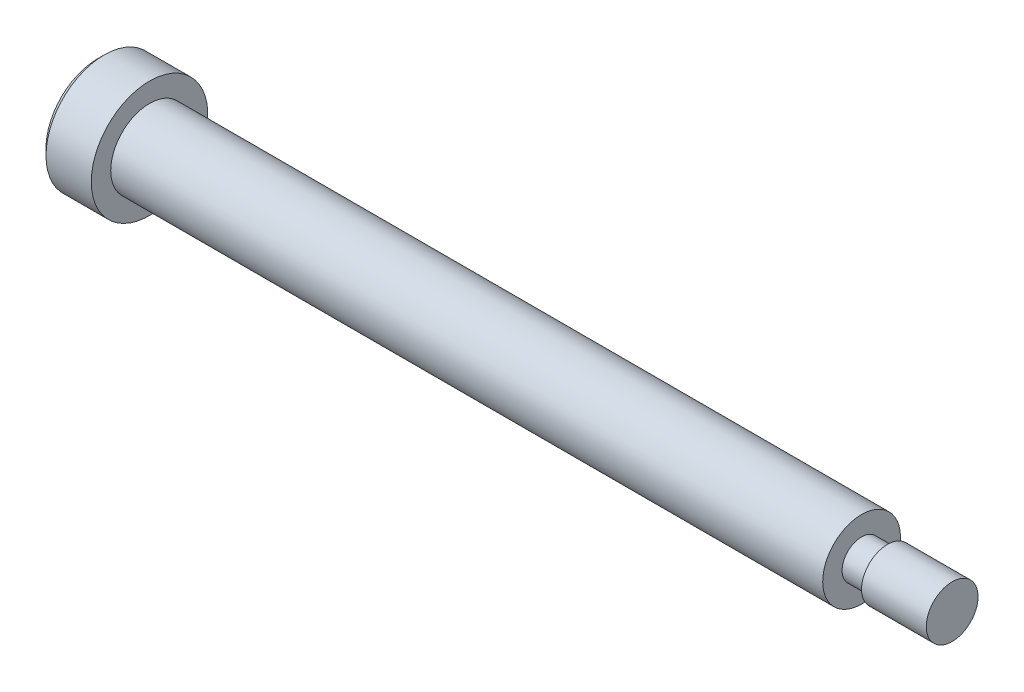
ISO-10303-21;
HEADER;
FILE_DESCRIPTION(('STEP AP214'),'2;1');
FILE_NAME('part.step','',(''),(''),'','','');
FILE_SCHEMA(('AUTOMOTIVE_DESIGN { 1 0 10303 214 1 1 1 1 }'));
ENDSEC;
DATA;
#1=APPLICATION_CONTEXT('core data for automotive mechanical design processes');
#2=APPLICATION_PROTOCOL_DEFINITION('international standard','automotive_design',2000,#1);
#3=PRODUCT_CONTEXT('',#1,'mechanical');
#4=PRODUCT('Part','Part','',(#3));
#5=PRODUCT_RELATED_PRODUCT_CATEGORY('part','',(#4));
#6=PRODUCT_DEFINITION_FORMATION('','',#4);
#7=PRODUCT_DEFINITION_CONTEXT('part definition',#1,'design');
#8=PRODUCT_DEFINITION('design','',#6,#7);
#9=PRODUCT_DEFINITION_SHAPE('','',#8);
#10=(LENGTH_UNIT() NAMED_UNIT(*) SI_UNIT(.MILLI.,.METRE.));
#11=(NAMED_UNIT(*) PLANE_ANGLE_UNIT() SI_UNIT($,.RADIAN.));
#12=(NAMED_UNIT(*) SI_UNIT($,.STERADIAN.) SOLID_ANGLE_UNIT());
#13=UNCERTAINTY_MEASURE_WITH_UNIT(LENGTH_MEASURE(1.E-05),#10,'distance_accuracy_value','');
#14=(GEOMETRIC_REPRESENTATION_CONTEXT(3) GLOBAL_UNCERTAINTY_ASSIGNED_CONTEXT((#13)) GLOBAL_UNIT_ASSIGNED_CONTEXT((#10,
#11,#12)) REPRESENTATION_CONTEXT('',''));
#15=CARTESIAN_POINT('',(0.,0.,0.));
#16=DIRECTION('',(0.,0.,1.));
#17=DIRECTION('',(1.,0.,0.));
#18=AXIS2_PLACEMENT_3D('',#15,#16,#17);
#19=CARTESIAN_POINT('',(0.,4.5,0.));
#20=DIRECTION('',(-1.,0.,0.));
#21=DIRECTION('',(0.,0.,1.));
#22=AXIS2_PLACEMENT_3D('',#19,#20,#21);
#23=PLANE('',#22);
#24=CARTESIAN_POINT('',(0.,0.,0.));
#25=DIRECTION('',(-1.,0.,0.));
#26=DIRECTION('',(0.,0.,1.));
#27=AXIS2_PLACEMENT_3D('',#24,#25,#26);
#28=CIRCLE('',#27,4.5);
#29=CARTESIAN_POINT('',(0.,0.,4.5));
#30=VERTEX_POINT('',#29);
#31=EDGE_CURVE('E156',#30,#30,#28,.T.);
#32=ORIENTED_EDGE('',*,*,#31,.F.);
#33=EDGE_LOOP('',(#32));
#34=FACE_BOUND('',#33,.T.);
#35=CARTESIAN_POINT('',(0.,0.,0.));
#36=DIRECTION('',(-1.,0.,0.));
#37=DIRECTION('',(0.,0.,1.));
#38=AXIS2_PLACEMENT_3D('',#35,#36,#37);
#39=CIRCLE('',#38,3.);
#40=CARTESIAN_POINT('',(0.,0.,3.));
#41=VERTEX_POINT('',#40);
#42=EDGE_CURVE('E133',#41,#41,#39,.T.);
#43=ORIENTED_EDGE('',*,*,#42,.T.);
#44=EDGE_LOOP('',(#43));
#45=FACE_BOUND('',#44,.T.);
#46=ADVANCED_FACE('F31',(#34,#45),#23,.F.);
#47=CARTESIAN_POINT('',(-15.4482466475727,0.,0.));
#48=DIRECTION('',(-1.,0.,0.));
#49=DIRECTION('',(0.,0.,1.));
#50=AXIS2_PLACEMENT_3D('',#47,#48,#49);
#51=CYLINDRICAL_SURFACE('',#50,4.5);
#52=CARTESIAN_POINT('',(-3.50000000000001,0.,0.));
#53=DIRECTION('',(1.,0.,0.));
#54=DIRECTION('',(0.,0.,-1.));
#55=AXIS2_PLACEMENT_3D('',#52,#53,#54);
#56=CIRCLE('',#55,4.5);
#57=CARTESIAN_POINT('',(-3.50000000000001,0.,-4.5));
#58=VERTEX_POINT('',#57);
#59=EDGE_CURVE('E11',#58,#58,#56,.T.);
#60=ORIENTED_EDGE('',*,*,#59,.T.);
#61=EDGE_LOOP('',(#60));
#62=FACE_BOUND('',#61,.T.);
#63=ORIENTED_EDGE('',*,*,#31,.T.);
#64=EDGE_LOOP('',(#63));
#65=FACE_BOUND('',#64,.T.);
#66=ADVANCED_FACE('F178',(#62,#65),#51,.T.);
#67=CARTESIAN_POINT('',(-4.,0.,0.));
#68=DIRECTION('',(1.,0.,0.));
#69=DIRECTION('',(0.,0.,-1.));
#70=AXIS2_PLACEMENT_3D('',#67,#68,#69);
#71=PLANE('',#70);
#72=DIRECTION('',(0.,-0.5,-0.866025403784439));
#73=VECTOR('',#72,1.);
#74=CARTESIAN_POINT('',(-4.,1.73205080756888,0.));
#75=LINE('',#74,#73);
#76=CARTESIAN_POINT('',(-4.,1.73205080756888,0.));
#77=VERTEX_POINT('',#76);
#78=CARTESIAN_POINT('',(-4.,0.866025403784438,-1.5));
#79=VERTEX_POINT('',#78);
#80=EDGE_CURVE('E120',#77,#79,#75,.T.);
#81=ORIENTED_EDGE('',*,*,#80,.F.);
#82=DIRECTION('',(0.,0.5,-0.866025403784439));
#83=VECTOR('',#82,1.);
#84=CARTESIAN_POINT('',(-4.,0.86602540378444,1.5));
#85=LINE('',#84,#83);
#86=CARTESIAN_POINT('',(-4.,0.86602540378444,1.5));
#87=VERTEX_POINT('',#86);
#88=EDGE_CURVE('E46',#87,#77,#85,.T.);
#89=ORIENTED_EDGE('',*,*,#88,.F.);
#90=DIRECTION('',(0.,1.,0.));
#91=VECTOR('',#90,1.);
#92=CARTESIAN_POINT('',(-4.,-0.866025403784439,1.5));
#93=LINE('',#92,#91);
#94=CARTESIAN_POINT('',(-4.,-0.866025403784439,1.5));
#95=VERTEX_POINT('',#94);
#96=EDGE_CURVE('E129',#95,#87,#93,.T.);
#97=ORIENTED_EDGE('',*,*,#96,.F.);
#98=DIRECTION('',(0.,0.5,0.866025403784438));
#99=VECTOR('',#98,1.);
#100=CARTESIAN_POINT('',(-4.,-1.73205080756888,0.));
#101=LINE('',#100,#99);
#102=CARTESIAN_POINT('',(-4.,-1.73205080756888,0.));
#103=VERTEX_POINT('',#102);
#104=EDGE_CURVE('E127',#103,#95,#101,.T.);
#105=ORIENTED_EDGE('',*,*,#104,.F.);
#106=DIRECTION('',(0.,-0.5,0.866025403784439));
#107=VECTOR('',#106,1.);
#108=CARTESIAN_POINT('',(-4.,-0.866025403784439,-1.5));
#109=LINE('',#108,#107);
#110=CARTESIAN_POINT('',(-4.,-0.866025403784439,-1.5));
#111=VERTEX_POINT('',#110);
#112=EDGE_CURVE('E94',#111,#103,#109,.T.);
#113=ORIENTED_EDGE('',*,*,#112,.F.);
#114=DIRECTION('',(0.,-1.,0.));
#115=VECTOR('',#114,1.);
#116=CARTESIAN_POINT('',(-4.,0.866025403784438,-1.5));
#117=LINE('',#116,#115);
#118=EDGE_CURVE('E123',#79,#111,#117,.T.);
#119=ORIENTED_EDGE('',*,*,#118,.F.);
#120=EDGE_LOOP('',(#81,#89,#97,#105,#113,#119));
#121=FACE_BOUND('',#120,.T.);
#122=CARTESIAN_POINT('',(-4.,0.,0.));
#123=DIRECTION('',(1.,0.,0.));
#124=DIRECTION('',(0.,0.,-1.));
#125=AXIS2_PLACEMENT_3D('',#122,#123,#124);
#126=CIRCLE('',#125,4.00000000000001);
#127=CARTESIAN_POINT('',(-4.,0.,-4.00000000000001));
#128=VERTEX_POINT('',#127);
#129=EDGE_CURVE('E39',#128,#128,#126,.F.);
#130=ORIENTED_EDGE('',*,*,#129,.T.);
#131=EDGE_LOOP('',(#130));
#132=FACE_BOUND('',#131,.T.);
#133=ADVANCED_FACE('F161',(#121,#132),#71,.F.);
#134=CARTESIAN_POINT('',(62.,2.,0.));
#135=DIRECTION('',(-1.,0.,0.));
#136=DIRECTION('',(0.,0.,1.));
#137=AXIS2_PLACEMENT_3D('',#134,#135,#136);
#138=PLANE('',#137);
#139=CARTESIAN_POINT('',(62.,0.,0.));
#140=DIRECTION('',(-1.,0.,0.));
#141=DIRECTION('',(0.,0.,1.));
#142=AXIS2_PLACEMENT_3D('',#139,#140,#141);
#143=CIRCLE('',#142,2.);
#144=CARTESIAN_POINT('',(62.,0.,2.));
#145=VERTEX_POINT('',#144);
#146=EDGE_CURVE('E153',#145,#145,#143,.T.);
#147=ORIENTED_EDGE('',*,*,#146,.F.);
#148=EDGE_LOOP('',(#147));
#149=FACE_BOUND('',#148,.T.);
#150=ADVANCED_FACE('F190',(#149),#138,.F.);
#151=CARTESIAN_POINT('',(-15.4482466475727,0.,0.));
#152=DIRECTION('',(-1.,0.,0.));
#153=DIRECTION('',(0.,0.,1.));
#154=AXIS2_PLACEMENT_3D('',#151,#152,#153);
#155=CYLINDRICAL_SURFACE('',#154,2.);
#156=CARTESIAN_POINT('',(57.,0.,0.));
#157=DIRECTION('',(-1.,0.,0.));
#158=DIRECTION('',(0.,0.,1.));
#159=AXIS2_PLACEMENT_3D('',#156,#157,#158);
#160=CIRCLE('',#159,2.);
#161=CARTESIAN_POINT('',(57.,0.,2.));
#162=VERTEX_POINT('',#161);
#163=EDGE_CURVE('E150',#162,#162,#160,.T.);
#164=ORIENTED_EDGE('',*,*,#163,.F.);
#165=EDGE_LOOP('',(#164));
#166=FACE_BOUND('',#165,.T.);
#167=ORIENTED_EDGE('',*,*,#146,.T.);
#168=EDGE_LOOP('',(#167));
#169=FACE_BOUND('',#168,.T.);
#170=ADVANCED_FACE('F194',(#166,#169),#155,.T.);
#171=CARTESIAN_POINT('',(57.,1.5,0.));
#172=DIRECTION('',(1.,0.,0.));
#173=DIRECTION('',(0.,0.,-1.));
#174=AXIS2_PLACEMENT_3D('',#171,#172,#173);
#175=PLANE('',#174);
#176=CARTESIAN_POINT('',(57.,0.,0.));
#177=DIRECTION('',(-1.,0.,0.));
#178=DIRECTION('',(0.,0.,1.));
#179=AXIS2_PLACEMENT_3D('',#176,#177,#178);
#180=CIRCLE('',#179,1.5);
#181=CARTESIAN_POINT('',(57.,0.,1.5));
#182=VERTEX_POINT('',#181);
#183=EDGE_CURVE('E147',#182,#182,#180,.T.);
#184=ORIENTED_EDGE('',*,*,#183,.F.);
#185=EDGE_LOOP('',(#184));
#186=FACE_BOUND('',#185,.T.);
#187=ORIENTED_EDGE('',*,*,#163,.T.);
#188=EDGE_LOOP('',(#187));
#189=FACE_BOUND('',#188,.T.);
#190=ADVANCED_FACE('F198',(#186,#189),#175,.F.);
#191=CARTESIAN_POINT('',(-15.4482466475727,0.,0.));
#192=DIRECTION('',(-1.,0.,0.));
#193=DIRECTION('',(0.,0.,1.));
#194=AXIS2_PLACEMENT_3D('',#191,#192,#193);
#195=CYLINDRICAL_SURFACE('',#194,1.5);
#196=CARTESIAN_POINT('',(55.,0.,0.));
#197=DIRECTION('',(-1.,0.,0.));
#198=DIRECTION('',(0.,0.,1.));
#199=AXIS2_PLACEMENT_3D('',#196,#197,#198);
#200=CIRCLE('',#199,1.5);
#201=CARTESIAN_POINT('',(55.,0.,1.5));
#202=VERTEX_POINT('',#201);
#203=EDGE_CURVE('E144',#202,#202,#200,.T.);
#204=ORIENTED_EDGE('',*,*,#203,.F.);
#205=EDGE_LOOP('',(#204));
#206=FACE_BOUND('',#205,.T.);
#207=ORIENTED_EDGE('',*,*,#183,.T.);
#208=EDGE_LOOP('',(#207));
#209=FACE_BOUND('',#208,.T.);
#210=ADVANCED_FACE('F202',(#206,#209),#195,.T.);
#211=CARTESIAN_POINT('',(55.,3.,0.));
#212=DIRECTION('',(-1.,0.,0.));
#213=DIRECTION('',(0.,0.,1.));
#214=AXIS2_PLACEMENT_3D('',#211,#212,#213);
#215=PLANE('',#214);
#216=CARTESIAN_POINT('',(55.,0.,0.));
#217=DIRECTION('',(-1.,0.,0.));
#218=DIRECTION('',(0.,0.,1.));
#219=AXIS2_PLACEMENT_3D('',#216,#217,#218);
#220=CIRCLE('',#219,3.);
#221=CARTESIAN_POINT('',(55.,0.,3.));
#222=VERTEX_POINT('',#221);
#223=EDGE_CURVE('E141',#222,#222,#220,.T.);
#224=ORIENTED_EDGE('',*,*,#223,.F.);
#225=EDGE_LOOP('',(#224));
#226=FACE_BOUND('',#225,.T.);
#227=ORIENTED_EDGE('',*,*,#203,.T.);
#228=EDGE_LOOP('',(#227));
#229=FACE_BOUND('',#228,.T.);
#230=ADVANCED_FACE('F173',(#226,#229),#215,.F.);
#231=CARTESIAN_POINT('',(-15.4482466475727,0.,0.));
#232=DIRECTION('',(-1.,0.,0.));
#233=DIRECTION('',(0.,0.,1.));
#234=AXIS2_PLACEMENT_3D('',#231,#232,#233);
#235=CYLINDRICAL_SURFACE('',#234,3.);
#236=ORIENTED_EDGE('',*,*,#42,.F.);
#237=EDGE_LOOP('',(#236));
#238=FACE_BOUND('',#237,.T.);
#239=ORIENTED_EDGE('',*,*,#223,.T.);
#240=EDGE_LOOP('',(#239));
#241=FACE_BOUND('',#240,.T.);
#242=ADVANCED_FACE('F165',(#238,#241),#235,.T.);
#243=CARTESIAN_POINT('',(-4.,0.,0.));
#244=DIRECTION('',(1.,0.,0.));
#245=DIRECTION('',(0.,0.,-1.));
#246=AXIS2_PLACEMENT_3D('',#243,#244,#245);
#247=CONICAL_SURFACE('',#246,4.00000000000001,0.785398163397447);
#248=ORIENTED_EDGE('',*,*,#59,.F.);
#249=EDGE_LOOP('',(#248));
#250=FACE_BOUND('',#249,.T.);
#251=ORIENTED_EDGE('',*,*,#129,.F.);
#252=EDGE_LOOP('',(#251));
#253=FACE_BOUND('',#252,.T.);
#254=ADVANCED_FACE('F33',(#250,#253),#247,.T.);
#255=CARTESIAN_POINT('',(-2.,0.86602540378444,1.5));
#256=DIRECTION('',(0.,0.866025403784439,0.5));
#257=DIRECTION('',(0.,-0.5,0.866025403784439));
#258=AXIS2_PLACEMENT_3D('',#255,#256,#257);
#259=PLANE('',#258);
#260=ORIENTED_EDGE('',*,*,#88,.T.);
#261=DIRECTION('',(-1.,0.,0.));
#262=VECTOR('',#261,1.);
#263=CARTESIAN_POINT('',(-2.,1.73205080756888,0.));
#264=LINE('',#263,#262);
#265=CARTESIAN_POINT('',(-2.,1.73205080756888,0.));
#266=VERTEX_POINT('',#265);
#267=EDGE_CURVE('E76',#266,#77,#264,.T.);
#268=ORIENTED_EDGE('',*,*,#267,.F.);
#269=DIRECTION('',(0.,0.5,-0.866025403784439));
#270=VECTOR('',#269,1.);
#271=CARTESIAN_POINT('',(-2.,0.86602540378444,1.5));
#272=LINE('',#271,#270);
#273=CARTESIAN_POINT('',(-2.,0.86602540378444,1.5));
#274=VERTEX_POINT('',#273);
#275=EDGE_CURVE('E131',#274,#266,#272,.T.);
#276=ORIENTED_EDGE('',*,*,#275,.F.);
#277=DIRECTION('',(-1.,0.,0.));
#278=VECTOR('',#277,1.);
#279=CARTESIAN_POINT('',(-2.,0.86602540378444,1.5));
#280=LINE('',#279,#278);
#281=EDGE_CURVE('E54',#274,#87,#280,.T.);
#282=ORIENTED_EDGE('',*,*,#281,.T.);
#283=EDGE_LOOP('',(#260,#268,#276,#282));
#284=FACE_BOUND('',#283,.T.);
#285=ADVANCED_FACE('F164',(#284),#259,.F.);
#286=CARTESIAN_POINT('',(-2.,-0.866025403784439,1.5));
#287=DIRECTION('',(0.,0.,1.));
#288=DIRECTION('',(0.,-1.,0.));
#289=AXIS2_PLACEMENT_3D('',#286,#287,#288);
#290=PLANE('',#289);
#291=ORIENTED_EDGE('',*,*,#96,.T.);
#292=ORIENTED_EDGE('',*,*,#281,.F.);
#293=DIRECTION('',(0.,1.,0.));
#294=VECTOR('',#293,1.);
#295=CARTESIAN_POINT('',(-2.,-0.866025403784439,1.5));
#296=LINE('',#295,#294);
#297=CARTESIAN_POINT('',(-2.,-0.866025403784439,1.5));
#298=VERTEX_POINT('',#297);
#299=EDGE_CURVE('E106',#298,#274,#296,.T.);
#300=ORIENTED_EDGE('',*,*,#299,.F.);
#301=DIRECTION('',(-1.,0.,0.));
#302=VECTOR('',#301,1.);
#303=CARTESIAN_POINT('',(-2.,-0.866025403784439,1.5));
#304=LINE('',#303,#302);
#305=EDGE_CURVE('E98',#298,#95,#304,.T.);
#306=ORIENTED_EDGE('',*,*,#305,.T.);
#307=EDGE_LOOP('',(#291,#292,#300,#306));
#308=FACE_BOUND('',#307,.T.);
#309=ADVANCED_FACE('F171',(#308),#290,.F.);
#310=CARTESIAN_POINT('',(-2.,-1.73205080756888,0.));
#311=DIRECTION('',(0.,-0.866025403784439,0.5));
#312=DIRECTION('',(0.,-0.5,-0.866025403784439));
#313=AXIS2_PLACEMENT_3D('',#310,#311,#312);
#314=PLANE('',#313);
#315=ORIENTED_EDGE('',*,*,#104,.T.);
#316=ORIENTED_EDGE('',*,*,#305,.F.);
#317=DIRECTION('',(0.,0.5,0.866025403784438));
#318=VECTOR('',#317,1.);
#319=CARTESIAN_POINT('',(-2.,-1.73205080756888,0.));
#320=LINE('',#319,#318);
#321=CARTESIAN_POINT('',(-2.,-1.73205080756888,0.));
#322=VERTEX_POINT('',#321);
#323=EDGE_CURVE('E102',#322,#298,#320,.T.);
#324=ORIENTED_EDGE('',*,*,#323,.F.);
#325=DIRECTION('',(-1.,0.,0.));
#326=VECTOR('',#325,1.);
#327=CARTESIAN_POINT('',(-2.,-1.73205080756888,0.));
#328=LINE('',#327,#326);
#329=EDGE_CURVE('E87',#322,#103,#328,.T.);
#330=ORIENTED_EDGE('',*,*,#329,.T.);
#331=EDGE_LOOP('',(#315,#316,#324,#330));
#332=FACE_BOUND('',#331,.T.);
#333=ADVANCED_FACE('F103',(#332),#314,.F.);
#334=CARTESIAN_POINT('',(-2.,-0.866025403784439,-1.5));
#335=DIRECTION('',(0.,-0.866025403784439,-0.5));
#336=DIRECTION('',(0.,0.5,-0.866025403784439));
#337=AXIS2_PLACEMENT_3D('',#334,#335,#336);
#338=PLANE('',#337);
#339=ORIENTED_EDGE('',*,*,#112,.T.);
#340=ORIENTED_EDGE('',*,*,#329,.F.);
#341=DIRECTION('',(0.,-0.5,0.866025403784439));
#342=VECTOR('',#341,1.);
#343=CARTESIAN_POINT('',(-2.,-0.866025403784439,-1.5));
#344=LINE('',#343,#342);
#345=CARTESIAN_POINT('',(-2.,-0.866025403784439,-1.5));
#346=VERTEX_POINT('',#345);
#347=EDGE_CURVE('E91',#346,#322,#344,.T.);
#348=ORIENTED_EDGE('',*,*,#347,.F.);
#349=DIRECTION('',(-1.,0.,0.));
#350=VECTOR('',#349,1.);
#351=CARTESIAN_POINT('',(-2.,-0.866025403784439,-1.5));
#352=LINE('',#351,#350);
#353=EDGE_CURVE('E99',#346,#111,#352,.T.);
#354=ORIENTED_EDGE('',*,*,#353,.T.);
#355=EDGE_LOOP('',(#339,#340,#348,#354));
#356=FACE_BOUND('',#355,.T.);
#357=ADVANCED_FACE('F89',(#356),#338,.F.);
#358=CARTESIAN_POINT('',(-2.,0.866025403784438,-1.5));
#359=DIRECTION('',(0.,0.,-1.));
#360=DIRECTION('',(0.,1.,0.));
#361=AXIS2_PLACEMENT_3D('',#358,#359,#360);
#362=PLANE('',#361);
#363=ORIENTED_EDGE('',*,*,#118,.T.);
#364=ORIENTED_EDGE('',*,*,#353,.F.);
#365=DIRECTION('',(0.,-1.,0.));
#366=VECTOR('',#365,1.);
#367=CARTESIAN_POINT('',(-2.,0.866025403784438,-1.5));
#368=LINE('',#367,#366);
#369=CARTESIAN_POINT('',(-2.,0.866025403784438,-1.5));
#370=VERTEX_POINT('',#369);
#371=EDGE_CURVE('E112',#370,#346,#368,.T.);
#372=ORIENTED_EDGE('',*,*,#371,.F.);
#373=DIRECTION('',(-1.,0.,0.));
#374=VECTOR('',#373,1.);
#375=CARTESIAN_POINT('',(-2.,0.866025403784438,-1.5));
#376=LINE('',#375,#374);
#377=EDGE_CURVE('E136',#370,#79,#376,.T.);
#378=ORIENTED_EDGE('',*,*,#377,.T.);
#379=EDGE_LOOP('',(#363,#364,#372,#378));
#380=FACE_BOUND('',#379,.T.);
#381=ADVANCED_FACE('F213',(#380),#362,.F.);
#382=CARTESIAN_POINT('',(-2.,1.73205080756888,0.));
#383=DIRECTION('',(0.,0.866025403784439,-0.5));
#384=DIRECTION('',(0.,0.5,0.866025403784439));
#385=AXIS2_PLACEMENT_3D('',#382,#383,#384);
#386=PLANE('',#385);
#387=ORIENTED_EDGE('',*,*,#80,.T.);
#388=ORIENTED_EDGE('',*,*,#377,.F.);
#389=DIRECTION('',(0.,-0.5,-0.866025403784439));
#390=VECTOR('',#389,1.);
#391=CARTESIAN_POINT('',(-2.,1.73205080756888,0.));
#392=LINE('',#391,#390);
#393=EDGE_CURVE('E114',#266,#370,#392,.T.);
#394=ORIENTED_EDGE('',*,*,#393,.F.);
#395=ORIENTED_EDGE('',*,*,#267,.T.);
#396=EDGE_LOOP('',(#387,#388,#394,#395));
#397=FACE_BOUND('',#396,.T.);
#398=ADVANCED_FACE('F210',(#397),#386,.F.);
#399=CARTESIAN_POINT('',(-2.,1.73205080756888,0.));
#400=DIRECTION('',(-1.,0.,0.));
#401=DIRECTION('',(0.,0.,1.));
#402=AXIS2_PLACEMENT_3D('',#399,#400,#401);
#403=PLANE('',#402);
#404=ORIENTED_EDGE('',*,*,#275,.T.);
#405=ORIENTED_EDGE('',*,*,#393,.T.);
#406=ORIENTED_EDGE('',*,*,#371,.T.);
#407=ORIENTED_EDGE('',*,*,#347,.T.);
#408=ORIENTED_EDGE('',*,*,#323,.T.);
#409=ORIENTED_EDGE('',*,*,#299,.T.);
#410=EDGE_LOOP('',(#404,#405,#406,#407,#408,#409));
#411=FACE_BOUND('',#410,.T.);
#412=ADVANCED_FACE('F109',(#411),#403,.T.);
#413=CLOSED_SHELL('',(#46,#66,#133,#150,#170,#190,#210,#230,#242,#254,#285,#309,#333,#357,#381,
#398,#412));
#414=MANIFOLD_SOLID_BREP('B2',#413);
#415=ADVANCED_BREP_SHAPE_REPRESENTATION('',(#18,#414),#14);
#416=SHAPE_DEFINITION_REPRESENTATION(#9,#415);
ENDSEC;
END-ISO-10303-21;
